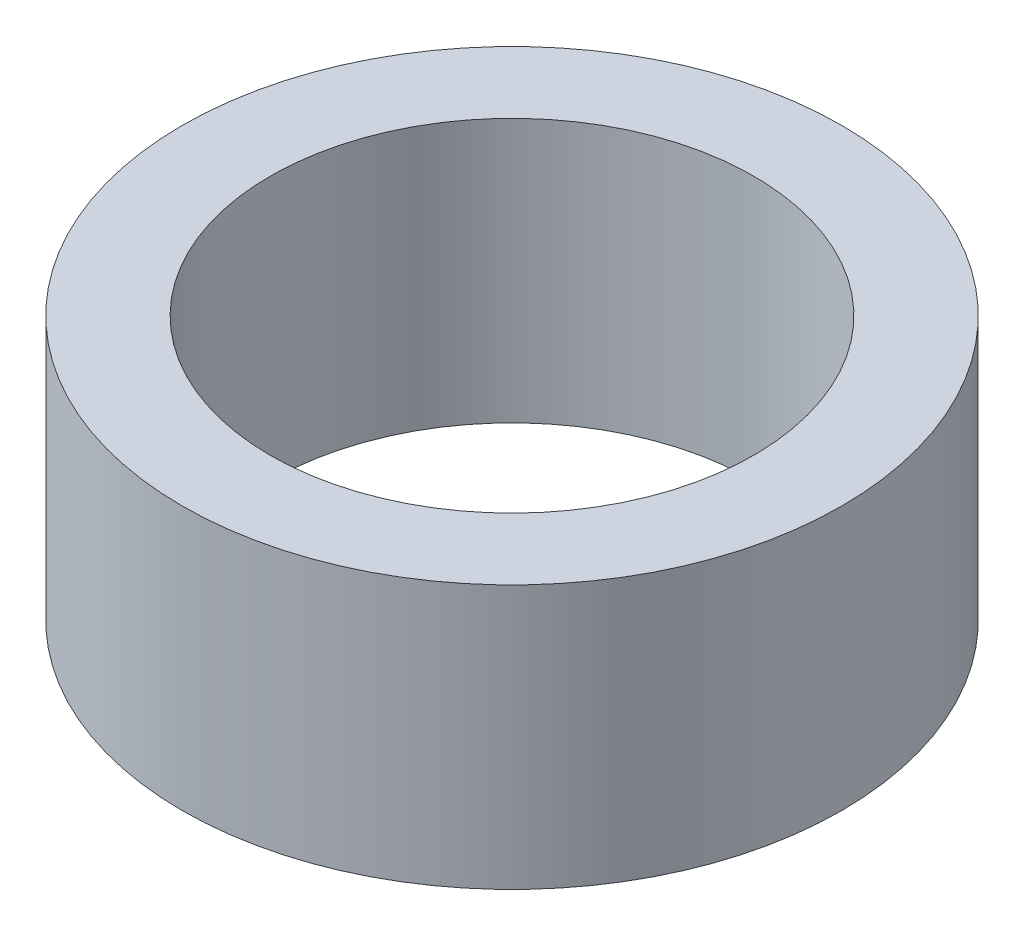
ISO-10303-21;
HEADER;
FILE_DESCRIPTION(('STEP AP214'),'2;1');
FILE_NAME('part.step','',(''),(''),'','','');
FILE_SCHEMA(('AUTOMOTIVE_DESIGN { 1 0 10303 214 1 1 1 1 }'));
ENDSEC;
DATA;
#1=APPLICATION_CONTEXT('core data for automotive mechanical design processes');
#2=APPLICATION_PROTOCOL_DEFINITION('international standard','automotive_design',2000,#1);
#3=PRODUCT_CONTEXT('',#1,'mechanical');
#4=PRODUCT('Part','Part','',(#3));
#5=PRODUCT_RELATED_PRODUCT_CATEGORY('part','',(#4));
#6=PRODUCT_DEFINITION_FORMATION('','',#4);
#7=PRODUCT_DEFINITION_CONTEXT('part definition',#1,'design');
#8=PRODUCT_DEFINITION('design','',#6,#7);
#9=PRODUCT_DEFINITION_SHAPE('','',#8);
#10=(LENGTH_UNIT() NAMED_UNIT(*) SI_UNIT(.MILLI.,.METRE.));
#11=(NAMED_UNIT(*) PLANE_ANGLE_UNIT() SI_UNIT($,.RADIAN.));
#12=(NAMED_UNIT(*) SI_UNIT($,.STERADIAN.) SOLID_ANGLE_UNIT());
#13=UNCERTAINTY_MEASURE_WITH_UNIT(LENGTH_MEASURE(1.E-05),#10,'distance_accuracy_value','');
#14=(GEOMETRIC_REPRESENTATION_CONTEXT(3) GLOBAL_UNCERTAINTY_ASSIGNED_CONTEXT((#13)) GLOBAL_UNIT_ASSIGNED_CONTEXT((#10,
#11,#12)) REPRESENTATION_CONTEXT('',''));
#15=CARTESIAN_POINT('',(0.,0.,0.));
#16=DIRECTION('',(0.,0.,1.));
#17=DIRECTION('',(1.,0.,0.));
#18=AXIS2_PLACEMENT_3D('',#15,#16,#17);
#19=CARTESIAN_POINT('',(0.,30.,0.));
#20=DIRECTION('',(0.,-1.,0.));
#21=DIRECTION('',(0.,0.,-1.));
#22=AXIS2_PLACEMENT_3D('',#19,#20,#21);
#23=CYLINDRICAL_SURFACE('',#22,37.5);
#24=CARTESIAN_POINT('',(0.,30.,0.));
#25=DIRECTION('',(0.,1.,0.));
#26=DIRECTION('',(0.,0.,1.));
#27=AXIS2_PLACEMENT_3D('',#24,#25,#26);
#28=CIRCLE('',#27,37.5);
#29=CARTESIAN_POINT('',(0.,30.,37.5));
#30=VERTEX_POINT('',#29);
#31=EDGE_CURVE('E10',#30,#30,#28,.T.);
#32=ORIENTED_EDGE('',*,*,#31,.F.);
#33=EDGE_LOOP('',(#32));
#34=FACE_BOUND('',#33,.T.);
#35=CARTESIAN_POINT('',(0.,0.,0.));
#36=DIRECTION('',(0.,1.,0.));
#37=DIRECTION('',(0.,0.,1.));
#38=AXIS2_PLACEMENT_3D('',#35,#36,#37);
#39=CIRCLE('',#38,37.5);
#40=CARTESIAN_POINT('',(0.,0.,37.5));
#41=VERTEX_POINT('',#40);
#42=EDGE_CURVE('E37',#41,#41,#39,.T.);
#43=ORIENTED_EDGE('',*,*,#42,.T.);
#44=EDGE_LOOP('',(#43));
#45=FACE_BOUND('',#44,.T.);
#46=ADVANCED_FACE('F40',(#34,#45),#23,.T.);
#47=CARTESIAN_POINT('',(0.,30.,0.));
#48=DIRECTION('',(0.,1.,0.));
#49=DIRECTION('',(0.,0.,1.));
#50=AXIS2_PLACEMENT_3D('',#47,#48,#49);
#51=PLANE('',#50);
#52=CARTESIAN_POINT('',(0.,30.,0.));
#53=DIRECTION('',(0.,1.,0.));
#54=DIRECTION('',(0.,0.,1.));
#55=AXIS2_PLACEMENT_3D('',#52,#53,#54);
#56=CIRCLE('',#55,27.5);
#57=CARTESIAN_POINT('',(0.,30.,27.5));
#58=VERTEX_POINT('',#57);
#59=EDGE_CURVE('E50',#58,#58,#56,.T.);
#60=ORIENTED_EDGE('',*,*,#59,.F.);
#61=EDGE_LOOP('',(#60));
#62=FACE_BOUND('',#61,.T.);
#63=ORIENTED_EDGE('',*,*,#31,.T.);
#64=EDGE_LOOP('',(#63));
#65=FACE_BOUND('',#64,.T.);
#66=ADVANCED_FACE('F59',(#62,#65),#51,.T.);
#67=CARTESIAN_POINT('',(0.,0.,0.));
#68=DIRECTION('',(0.,1.,0.));
#69=DIRECTION('',(0.,0.,1.));
#70=AXIS2_PLACEMENT_3D('',#67,#68,#69);
#71=PLANE('',#70);
#72=CARTESIAN_POINT('',(0.,0.,0.));
#73=DIRECTION('',(0.,1.,0.));
#74=DIRECTION('',(0.,0.,1.));
#75=AXIS2_PLACEMENT_3D('',#72,#73,#74);
#76=CIRCLE('',#75,27.5);
#77=CARTESIAN_POINT('',(0.,0.,27.5));
#78=VERTEX_POINT('',#77);
#79=EDGE_CURVE('E47',#78,#78,#76,.T.);
#80=ORIENTED_EDGE('',*,*,#79,.T.);
#81=EDGE_LOOP('',(#80));
#82=FACE_BOUND('',#81,.T.);
#83=ORIENTED_EDGE('',*,*,#42,.F.);
#84=EDGE_LOOP('',(#83));
#85=FACE_BOUND('',#84,.T.);
#86=ADVANCED_FACE('F58',(#82,#85),#71,.F.);
#87=CARTESIAN_POINT('',(0.,30.,0.));
#88=DIRECTION('',(0.,-1.,0.));
#89=DIRECTION('',(0.,0.,-1.));
#90=AXIS2_PLACEMENT_3D('',#87,#88,#89);
#91=CYLINDRICAL_SURFACE('',#90,27.5);
#92=ORIENTED_EDGE('',*,*,#59,.T.);
#93=EDGE_LOOP('',(#92));
#94=FACE_BOUND('',#93,.T.);
#95=ORIENTED_EDGE('',*,*,#79,.F.);
#96=EDGE_LOOP('',(#95));
#97=FACE_BOUND('',#96,.T.);
#98=ADVANCED_FACE('F54',(#94,#97),#91,.F.);
#99=CLOSED_SHELL('',(#46,#66,#86,#98));
#100=MANIFOLD_SOLID_BREP('B2',#99);
#101=ADVANCED_BREP_SHAPE_REPRESENTATION('',(#18,#100),#14);
#102=SHAPE_DEFINITION_REPRESENTATION(#9,#101);
ENDSEC;
END-ISO-10303-21;
